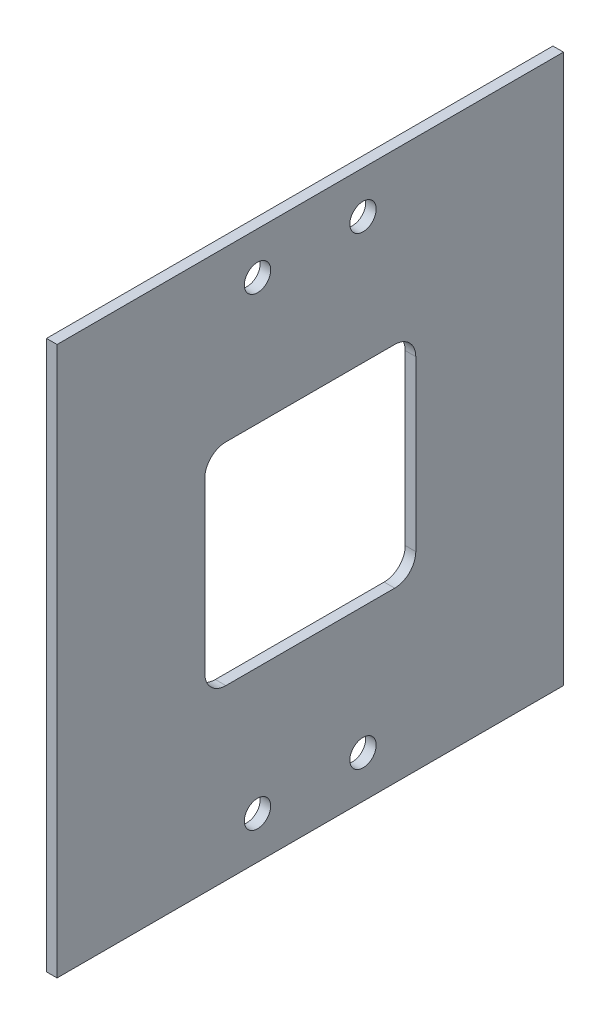
ISO-10303-21;
HEADER;
FILE_DESCRIPTION(('STEP AP214'),'2;1');
FILE_NAME('part.step','',(''),(''),'','','');
FILE_SCHEMA(('AUTOMOTIVE_DESIGN { 1 0 10303 214 1 1 1 1 }'));
ENDSEC;
DATA;
#1=APPLICATION_CONTEXT('core data for automotive mechanical design processes');
#2=APPLICATION_PROTOCOL_DEFINITION('international standard','automotive_design',2000,#1);
#3=PRODUCT_CONTEXT('',#1,'mechanical');
#4=PRODUCT('Part','Part','',(#3));
#5=PRODUCT_RELATED_PRODUCT_CATEGORY('part','',(#4));
#6=PRODUCT_DEFINITION_FORMATION('','',#4);
#7=PRODUCT_DEFINITION_CONTEXT('part definition',#1,'design');
#8=PRODUCT_DEFINITION('design','',#6,#7);
#9=PRODUCT_DEFINITION_SHAPE('','',#8);
#10=(LENGTH_UNIT() NAMED_UNIT(*) SI_UNIT(.MILLI.,.METRE.));
#11=(NAMED_UNIT(*) PLANE_ANGLE_UNIT() SI_UNIT($,.RADIAN.));
#12=(NAMED_UNIT(*) SI_UNIT($,.STERADIAN.) SOLID_ANGLE_UNIT());
#13=UNCERTAINTY_MEASURE_WITH_UNIT(LENGTH_MEASURE(1.E-05),#10,'distance_accuracy_value','');
#14=(GEOMETRIC_REPRESENTATION_CONTEXT(3) GLOBAL_UNCERTAINTY_ASSIGNED_CONTEXT((#13)) GLOBAL_UNIT_ASSIGNED_CONTEXT((#10,
#11,#12)) REPRESENTATION_CONTEXT('',''));
#15=CARTESIAN_POINT('',(0.,0.,0.));
#16=DIRECTION('',(0.,0.,1.));
#17=DIRECTION('',(1.,0.,0.));
#18=AXIS2_PLACEMENT_3D('',#15,#16,#17);
#19=CARTESIAN_POINT('',(3.175,82.55,0.));
#20=DIRECTION('',(0.,0.,-1.));
#21=DIRECTION('',(0.,1.,0.));
#22=AXIS2_PLACEMENT_3D('',#19,#20,#21);
#23=PLANE('',#22);
#24=DIRECTION('',(0.,-1.,0.));
#25=VECTOR('',#24,1.);
#26=CARTESIAN_POINT('',(0.,82.55,0.));
#27=LINE('',#26,#25);
#28=CARTESIAN_POINT('',(0.,82.55,0.));
#29=VERTEX_POINT('',#28);
#30=CARTESIAN_POINT('',(0.,-82.55,0.));
#31=VERTEX_POINT('',#30);
#32=EDGE_CURVE('E234',#29,#31,#27,.T.);
#33=ORIENTED_EDGE('',*,*,#32,.T.);
#34=DIRECTION('',(-1.,0.,0.));
#35=VECTOR('',#34,1.);
#36=CARTESIAN_POINT('',(3.175,-82.55,0.));
#37=LINE('',#36,#35);
#38=CARTESIAN_POINT('',(3.175,-82.55,0.));
#39=VERTEX_POINT('',#38);
#40=EDGE_CURVE('E11',#39,#31,#37,.T.);
#41=ORIENTED_EDGE('',*,*,#40,.F.);
#42=DIRECTION('',(0.,-1.,0.));
#43=VECTOR('',#42,1.);
#44=CARTESIAN_POINT('',(3.175,82.55,0.));
#45=LINE('',#44,#43);
#46=CARTESIAN_POINT('',(3.175,82.55,0.));
#47=VERTEX_POINT('',#46);
#48=EDGE_CURVE('E251',#47,#39,#45,.T.);
#49=ORIENTED_EDGE('',*,*,#48,.F.);
#50=DIRECTION('',(-1.,0.,0.));
#51=VECTOR('',#50,1.);
#52=CARTESIAN_POINT('',(3.175,82.55,0.));
#53=LINE('',#52,#51);
#54=EDGE_CURVE('E265',#47,#29,#53,.T.);
#55=ORIENTED_EDGE('',*,*,#54,.T.);
#56=EDGE_LOOP('',(#33,#41,#49,#55));
#57=FACE_BOUND('',#56,.T.);
#58=ADVANCED_FACE('F41',(#57),#23,.F.);
#59=CARTESIAN_POINT('',(3.175,-82.55,-152.4));
#60=DIRECTION('',(0.,1.,0.));
#61=DIRECTION('',(0.,0.,1.));
#62=AXIS2_PLACEMENT_3D('',#59,#60,#61);
#63=PLANE('',#62);
#64=DIRECTION('',(0.,0.,-1.));
#65=VECTOR('',#64,1.);
#66=CARTESIAN_POINT('',(0.,-82.55,-152.4));
#67=LINE('',#66,#65);
#68=CARTESIAN_POINT('',(0.,-82.55,-152.4));
#69=VERTEX_POINT('',#68);
#70=EDGE_CURVE('E269',#31,#69,#67,.T.);
#71=ORIENTED_EDGE('',*,*,#70,.T.);
#72=DIRECTION('',(-1.,0.,0.));
#73=VECTOR('',#72,1.);
#74=CARTESIAN_POINT('',(3.175,-82.55,-152.4));
#75=LINE('',#74,#73);
#76=CARTESIAN_POINT('',(3.175,-82.55,-152.4));
#77=VERTEX_POINT('',#76);
#78=EDGE_CURVE('E49',#77,#69,#75,.T.);
#79=ORIENTED_EDGE('',*,*,#78,.F.);
#80=DIRECTION('',(0.,0.,-1.));
#81=VECTOR('',#80,1.);
#82=CARTESIAN_POINT('',(3.175,-82.55,-152.4));
#83=LINE('',#82,#81);
#84=EDGE_CURVE('E255',#39,#77,#83,.T.);
#85=ORIENTED_EDGE('',*,*,#84,.F.);
#86=ORIENTED_EDGE('',*,*,#40,.T.);
#87=EDGE_LOOP('',(#71,#79,#85,#86));
#88=FACE_BOUND('',#87,.T.);
#89=ADVANCED_FACE('F303',(#88),#63,.F.);
#90=CARTESIAN_POINT('',(3.175,82.55,-152.4));
#91=DIRECTION('',(0.,0.,1.));
#92=DIRECTION('',(0.,-1.,0.));
#93=AXIS2_PLACEMENT_3D('',#90,#91,#92);
#94=PLANE('',#93);
#95=DIRECTION('',(0.,1.,0.));
#96=VECTOR('',#95,1.);
#97=CARTESIAN_POINT('',(0.,82.55,-152.4));
#98=LINE('',#97,#96);
#99=CARTESIAN_POINT('',(0.,82.55,-152.4));
#100=VERTEX_POINT('',#99);
#101=EDGE_CURVE('E272',#69,#100,#98,.T.);
#102=ORIENTED_EDGE('',*,*,#101,.T.);
#103=DIRECTION('',(-1.,0.,0.));
#104=VECTOR('',#103,1.);
#105=CARTESIAN_POINT('',(3.175,82.55,-152.4));
#106=LINE('',#105,#104);
#107=CARTESIAN_POINT('',(3.175,82.55,-152.4));
#108=VERTEX_POINT('',#107);
#109=EDGE_CURVE('E280',#108,#100,#106,.T.);
#110=ORIENTED_EDGE('',*,*,#109,.F.);
#111=DIRECTION('',(0.,1.,0.));
#112=VECTOR('',#111,1.);
#113=CARTESIAN_POINT('',(3.175,82.55,-152.4));
#114=LINE('',#113,#112);
#115=EDGE_CURVE('E259',#77,#108,#114,.T.);
#116=ORIENTED_EDGE('',*,*,#115,.F.);
#117=ORIENTED_EDGE('',*,*,#78,.T.);
#118=EDGE_LOOP('',(#102,#110,#116,#117));
#119=FACE_BOUND('',#118,.T.);
#120=ADVANCED_FACE('F289',(#119),#94,.F.);
#121=CARTESIAN_POINT('',(3.175,82.55,-152.4));
#122=DIRECTION('',(0.,-1.,0.));
#123=DIRECTION('',(0.,0.,-1.));
#124=AXIS2_PLACEMENT_3D('',#121,#122,#123);
#125=PLANE('',#124);
#126=DIRECTION('',(0.,0.,1.));
#127=VECTOR('',#126,1.);
#128=CARTESIAN_POINT('',(0.,82.55,-152.4));
#129=LINE('',#128,#127);
#130=EDGE_CURVE('E256',#100,#29,#129,.T.);
#131=ORIENTED_EDGE('',*,*,#130,.T.);
#132=ORIENTED_EDGE('',*,*,#54,.F.);
#133=DIRECTION('',(0.,0.,1.));
#134=VECTOR('',#133,1.);
#135=CARTESIAN_POINT('',(3.175,82.55,-152.4));
#136=LINE('',#135,#134);
#137=EDGE_CURVE('E262',#108,#47,#136,.T.);
#138=ORIENTED_EDGE('',*,*,#137,.F.);
#139=ORIENTED_EDGE('',*,*,#109,.T.);
#140=EDGE_LOOP('',(#131,#132,#138,#139));
#141=FACE_BOUND('',#140,.T.);
#142=ADVANCED_FACE('F298',(#141),#125,.F.);
#143=CARTESIAN_POINT('',(3.175,-82.55,0.));
#144=DIRECTION('',(-1.,0.,0.));
#145=DIRECTION('',(0.,0.,1.));
#146=AXIS2_PLACEMENT_3D('',#143,#144,#145);
#147=PLANE('',#146);
#148=CARTESIAN_POINT('',(3.175,-69.85,-60.325));
#149=DIRECTION('',(-1.,0.,0.));
#150=DIRECTION('',(0.,0.,1.));
#151=AXIS2_PLACEMENT_3D('',#148,#149,#150);
#152=CIRCLE('',#151,3.96875);
#153=CARTESIAN_POINT('',(3.175,-69.85,-56.35625));
#154=VERTEX_POINT('',#153);
#155=EDGE_CURVE('E366',#154,#154,#152,.T.);
#156=ORIENTED_EDGE('',*,*,#155,.T.);
#157=EDGE_LOOP('',(#156));
#158=FACE_BOUND('',#157,.T.);
#159=CARTESIAN_POINT('',(3.175,-69.85,-92.075));
#160=DIRECTION('',(-1.,0.,0.));
#161=DIRECTION('',(0.,0.,1.));
#162=AXIS2_PLACEMENT_3D('',#159,#160,#161);
#163=CIRCLE('',#162,3.96874999999999);
#164=CARTESIAN_POINT('',(3.175,-69.85,-88.10625));
#165=VERTEX_POINT('',#164);
#166=EDGE_CURVE('E376',#165,#165,#163,.T.);
#167=ORIENTED_EDGE('',*,*,#166,.T.);
#168=EDGE_LOOP('',(#167));
#169=FACE_BOUND('',#168,.T.);
#170=CARTESIAN_POINT('',(3.175,69.85,-92.075));
#171=DIRECTION('',(-1.,0.,0.));
#172=DIRECTION('',(0.,0.,1.));
#173=AXIS2_PLACEMENT_3D('',#170,#171,#172);
#174=CIRCLE('',#173,3.96875);
#175=CARTESIAN_POINT('',(3.175,69.85,-88.10625));
#176=VERTEX_POINT('',#175);
#177=EDGE_CURVE('E384',#176,#176,#174,.T.);
#178=ORIENTED_EDGE('',*,*,#177,.T.);
#179=EDGE_LOOP('',(#178));
#180=FACE_BOUND('',#179,.T.);
#181=CARTESIAN_POINT('',(3.175,69.85,-60.325));
#182=DIRECTION('',(-1.,0.,0.));
#183=DIRECTION('',(0.,0.,1.));
#184=AXIS2_PLACEMENT_3D('',#181,#182,#183);
#185=CIRCLE('',#184,3.96875);
#186=CARTESIAN_POINT('',(3.175,69.85,-56.35625));
#187=VERTEX_POINT('',#186);
#188=EDGE_CURVE('E210',#187,#187,#185,.T.);
#189=ORIENTED_EDGE('',*,*,#188,.T.);
#190=EDGE_LOOP('',(#189));
#191=FACE_BOUND('',#190,.T.);
#192=CARTESIAN_POINT('',(3.175,-25.4,-101.6));
#193=DIRECTION('',(-1.,0.,0.));
#194=DIRECTION('',(0.,0.,1.));
#195=AXIS2_PLACEMENT_3D('',#192,#193,#194);
#196=CIRCLE('',#195,6.35000000000001);
#197=CARTESIAN_POINT('',(3.175,-25.4,-107.95));
#198=VERTEX_POINT('',#197);
#199=CARTESIAN_POINT('',(3.175,-31.75,-101.6));
#200=VERTEX_POINT('',#199);
#201=EDGE_CURVE('E163',#198,#200,#196,.T.);
#202=ORIENTED_EDGE('',*,*,#201,.T.);
#203=DIRECTION('',(0.,0.,1.));
#204=VECTOR('',#203,1.);
#205=CARTESIAN_POINT('',(3.175,-31.75,-76.2));
#206=LINE('',#205,#204);
#207=CARTESIAN_POINT('',(3.175,-31.75,-50.8));
#208=VERTEX_POINT('',#207);
#209=EDGE_CURVE('E156',#200,#208,#206,.T.);
#210=ORIENTED_EDGE('',*,*,#209,.T.);
#211=CARTESIAN_POINT('',(3.175,-25.4,-50.8));
#212=DIRECTION('',(-1.,0.,0.));
#213=DIRECTION('',(0.,0.,1.));
#214=AXIS2_PLACEMENT_3D('',#211,#212,#213);
#215=CIRCLE('',#214,6.35000000000001);
#216=CARTESIAN_POINT('',(3.175,-25.4,-44.45));
#217=VERTEX_POINT('',#216);
#218=EDGE_CURVE('E166',#208,#217,#215,.T.);
#219=ORIENTED_EDGE('',*,*,#218,.T.);
#220=DIRECTION('',(0.,1.,0.));
#221=VECTOR('',#220,1.);
#222=CARTESIAN_POINT('',(3.175,-174.906065520897,-44.45));
#223=LINE('',#222,#221);
#224=CARTESIAN_POINT('',(3.175,25.4,-44.45));
#225=VERTEX_POINT('',#224);
#226=EDGE_CURVE('E59',#217,#225,#223,.T.);
#227=ORIENTED_EDGE('',*,*,#226,.T.);
#228=CARTESIAN_POINT('',(3.175,25.4,-50.8));
#229=DIRECTION('',(-1.,0.,0.));
#230=DIRECTION('',(0.,0.,1.));
#231=AXIS2_PLACEMENT_3D('',#228,#229,#230);
#232=CIRCLE('',#231,6.35000000000001);
#233=CARTESIAN_POINT('',(3.175,31.75,-50.8));
#234=VERTEX_POINT('',#233);
#235=EDGE_CURVE('E190',#225,#234,#232,.T.);
#236=ORIENTED_EDGE('',*,*,#235,.T.);
#237=DIRECTION('',(0.,0.,-1.));
#238=VECTOR('',#237,1.);
#239=CARTESIAN_POINT('',(3.175,31.75,-76.2));
#240=LINE('',#239,#238);
#241=CARTESIAN_POINT('',(3.175,31.75,-101.6));
#242=VERTEX_POINT('',#241);
#243=EDGE_CURVE('E194',#234,#242,#240,.T.);
#244=ORIENTED_EDGE('',*,*,#243,.T.);
#245=CARTESIAN_POINT('',(3.175,25.4,-101.6));
#246=DIRECTION('',(-1.,0.,0.));
#247=DIRECTION('',(0.,0.,1.));
#248=AXIS2_PLACEMENT_3D('',#245,#246,#247);
#249=CIRCLE('',#248,6.35000000000001);
#250=CARTESIAN_POINT('',(3.175,25.4,-107.95));
#251=VERTEX_POINT('',#250);
#252=EDGE_CURVE('E198',#242,#251,#249,.T.);
#253=ORIENTED_EDGE('',*,*,#252,.T.);
#254=DIRECTION('',(0.,-1.,0.));
#255=VECTOR('',#254,1.);
#256=CARTESIAN_POINT('',(3.175,-174.906065520897,-107.95));
#257=LINE('',#256,#255);
#258=EDGE_CURVE('E202',#251,#198,#257,.T.);
#259=ORIENTED_EDGE('',*,*,#258,.T.);
#260=EDGE_LOOP('',(#202,#210,#219,#227,#236,#244,#253,#259));
#261=FACE_BOUND('',#260,.T.);
#262=ORIENTED_EDGE('',*,*,#48,.T.);
#263=ORIENTED_EDGE('',*,*,#84,.T.);
#264=ORIENTED_EDGE('',*,*,#115,.T.);
#265=ORIENTED_EDGE('',*,*,#137,.T.);
#266=EDGE_LOOP('',(#262,#263,#264,#265));
#267=FACE_BOUND('',#266,.T.);
#268=ADVANCED_FACE('F171',(#158,#169,#180,#191,#261,#267),#147,.F.);
#269=CARTESIAN_POINT('',(0.,-82.55,0.));
#270=DIRECTION('',(-1.,0.,0.));
#271=DIRECTION('',(0.,0.,1.));
#272=AXIS2_PLACEMENT_3D('',#269,#270,#271);
#273=PLANE('',#272);
#274=CARTESIAN_POINT('',(0.,-69.85,-60.325));
#275=DIRECTION('',(-1.,0.,0.));
#276=DIRECTION('',(0.,0.,1.));
#277=AXIS2_PLACEMENT_3D('',#274,#275,#276);
#278=CIRCLE('',#277,3.96875);
#279=CARTESIAN_POINT('',(0.,-69.85,-56.35625));
#280=VERTEX_POINT('',#279);
#281=EDGE_CURVE('E369',#280,#280,#278,.T.);
#282=ORIENTED_EDGE('',*,*,#281,.F.);
#283=EDGE_LOOP('',(#282));
#284=FACE_BOUND('',#283,.T.);
#285=CARTESIAN_POINT('',(0.,-69.85,-92.075));
#286=DIRECTION('',(-1.,0.,0.));
#287=DIRECTION('',(0.,0.,1.));
#288=AXIS2_PLACEMENT_3D('',#285,#286,#287);
#289=CIRCLE('',#288,3.96874999999999);
#290=CARTESIAN_POINT('',(0.,-69.85,-88.10625));
#291=VERTEX_POINT('',#290);
#292=EDGE_CURVE('E373',#291,#291,#289,.T.);
#293=ORIENTED_EDGE('',*,*,#292,.F.);
#294=EDGE_LOOP('',(#293));
#295=FACE_BOUND('',#294,.T.);
#296=CARTESIAN_POINT('',(0.,69.85,-92.075));
#297=DIRECTION('',(-1.,0.,0.));
#298=DIRECTION('',(0.,0.,1.));
#299=AXIS2_PLACEMENT_3D('',#296,#297,#298);
#300=CIRCLE('',#299,3.96875);
#301=CARTESIAN_POINT('',(0.,69.85,-88.10625));
#302=VERTEX_POINT('',#301);
#303=EDGE_CURVE('E380',#302,#302,#300,.T.);
#304=ORIENTED_EDGE('',*,*,#303,.F.);
#305=EDGE_LOOP('',(#304));
#306=FACE_BOUND('',#305,.T.);
#307=CARTESIAN_POINT('',(0.,69.85,-60.325));
#308=DIRECTION('',(-1.,0.,0.));
#309=DIRECTION('',(0.,0.,1.));
#310=AXIS2_PLACEMENT_3D('',#307,#308,#309);
#311=CIRCLE('',#310,3.96875);
#312=CARTESIAN_POINT('',(0.,69.85,-56.35625));
#313=VERTEX_POINT('',#312);
#314=EDGE_CURVE('E185',#313,#313,#311,.T.);
#315=ORIENTED_EDGE('',*,*,#314,.F.);
#316=EDGE_LOOP('',(#315));
#317=FACE_BOUND('',#316,.T.);
#318=DIRECTION('',(0.,0.,1.));
#319=VECTOR('',#318,1.);
#320=CARTESIAN_POINT('',(0.,-31.75,-76.2));
#321=LINE('',#320,#319);
#322=CARTESIAN_POINT('',(0.,-31.75,-101.6));
#323=VERTEX_POINT('',#322);
#324=CARTESIAN_POINT('',(0.,-31.75,-50.8));
#325=VERTEX_POINT('',#324);
#326=EDGE_CURVE('E70',#323,#325,#321,.T.);
#327=ORIENTED_EDGE('',*,*,#326,.F.);
#328=CARTESIAN_POINT('',(0.,-25.4,-101.6));
#329=DIRECTION('',(-1.,0.,0.));
#330=DIRECTION('',(0.,0.,1.));
#331=AXIS2_PLACEMENT_3D('',#328,#329,#330);
#332=CIRCLE('',#331,6.35000000000001);
#333=CARTESIAN_POINT('',(0.,-25.4,-107.95));
#334=VERTEX_POINT('',#333);
#335=EDGE_CURVE('E176',#334,#323,#332,.T.);
#336=ORIENTED_EDGE('',*,*,#335,.F.);
#337=DIRECTION('',(0.,-1.,0.));
#338=VECTOR('',#337,1.);
#339=CARTESIAN_POINT('',(0.,-174.906065520897,-107.95));
#340=LINE('',#339,#338);
#341=CARTESIAN_POINT('',(0.,25.4,-107.95));
#342=VERTEX_POINT('',#341);
#343=EDGE_CURVE('E182',#342,#334,#340,.T.);
#344=ORIENTED_EDGE('',*,*,#343,.F.);
#345=CARTESIAN_POINT('',(0.,25.4,-101.6));
#346=DIRECTION('',(-1.,0.,0.));
#347=DIRECTION('',(0.,0.,1.));
#348=AXIS2_PLACEMENT_3D('',#345,#346,#347);
#349=CIRCLE('',#348,6.35000000000001);
#350=CARTESIAN_POINT('',(0.,31.75,-101.6));
#351=VERTEX_POINT('',#350);
#352=EDGE_CURVE('E225',#351,#342,#349,.T.);
#353=ORIENTED_EDGE('',*,*,#352,.F.);
#354=DIRECTION('',(0.,0.,-1.));
#355=VECTOR('',#354,1.);
#356=CARTESIAN_POINT('',(0.,31.75,-76.2));
#357=LINE('',#356,#355);
#358=CARTESIAN_POINT('',(0.,31.75,-50.8));
#359=VERTEX_POINT('',#358);
#360=EDGE_CURVE('E221',#359,#351,#357,.T.);
#361=ORIENTED_EDGE('',*,*,#360,.F.);
#362=CARTESIAN_POINT('',(0.,25.4,-50.8));
#363=DIRECTION('',(-1.,0.,0.));
#364=DIRECTION('',(0.,0.,1.));
#365=AXIS2_PLACEMENT_3D('',#362,#363,#364);
#366=CIRCLE('',#365,6.35000000000001);
#367=CARTESIAN_POINT('',(0.,25.4,-44.45));
#368=VERTEX_POINT('',#367);
#369=EDGE_CURVE('E217',#368,#359,#366,.T.);
#370=ORIENTED_EDGE('',*,*,#369,.F.);
#371=DIRECTION('',(0.,1.,0.));
#372=VECTOR('',#371,1.);
#373=CARTESIAN_POINT('',(0.,-174.906065520897,-44.45));
#374=LINE('',#373,#372);
#375=CARTESIAN_POINT('',(0.,-25.4,-44.45));
#376=VERTEX_POINT('',#375);
#377=EDGE_CURVE('E213',#376,#368,#374,.T.);
#378=ORIENTED_EDGE('',*,*,#377,.F.);
#379=CARTESIAN_POINT('',(0.,-25.4,-50.8));
#380=DIRECTION('',(-1.,0.,0.));
#381=DIRECTION('',(0.,0.,1.));
#382=AXIS2_PLACEMENT_3D('',#379,#380,#381);
#383=CIRCLE('',#382,6.35000000000001);
#384=EDGE_CURVE('E209',#325,#376,#383,.T.);
#385=ORIENTED_EDGE('',*,*,#384,.F.);
#386=EDGE_LOOP('',(#327,#336,#344,#353,#361,#370,#378,#385));
#387=FACE_BOUND('',#386,.T.);
#388=ORIENTED_EDGE('',*,*,#32,.F.);
#389=ORIENTED_EDGE('',*,*,#130,.F.);
#390=ORIENTED_EDGE('',*,*,#101,.F.);
#391=ORIENTED_EDGE('',*,*,#70,.F.);
#392=EDGE_LOOP('',(#388,#389,#390,#391));
#393=FACE_BOUND('',#392,.T.);
#394=ADVANCED_FACE('F295',(#284,#295,#306,#317,#387,#393),#273,.T.);
#395=CARTESIAN_POINT('',(3.175,-31.75,-76.2));
#396=DIRECTION('',(0.,-1.,0.));
#397=DIRECTION('',(0.,0.,-1.));
#398=AXIS2_PLACEMENT_3D('',#395,#396,#397);
#399=PLANE('',#398);
#400=ORIENTED_EDGE('',*,*,#326,.T.);
#401=DIRECTION('',(-1.,0.,0.));
#402=VECTOR('',#401,1.);
#403=CARTESIAN_POINT('',(3.175,-31.75,-50.8));
#404=LINE('',#403,#402);
#405=EDGE_CURVE('E152',#208,#325,#404,.T.);
#406=ORIENTED_EDGE('',*,*,#405,.F.);
#407=ORIENTED_EDGE('',*,*,#209,.F.);
#408=DIRECTION('',(-1.,0.,0.));
#409=VECTOR('',#408,1.);
#410=CARTESIAN_POINT('',(3.175,-31.75,-101.6));
#411=LINE('',#410,#409);
#412=EDGE_CURVE('E232',#200,#323,#411,.T.);
#413=ORIENTED_EDGE('',*,*,#412,.T.);
#414=EDGE_LOOP('',(#400,#406,#407,#413));
#415=FACE_BOUND('',#414,.T.);
#416=ADVANCED_FACE('F154',(#415),#399,.F.);
#417=CARTESIAN_POINT('',(3.175,-25.4,-101.6));
#418=DIRECTION('',(-1.,0.,0.));
#419=DIRECTION('',(0.,0.,1.));
#420=AXIS2_PLACEMENT_3D('',#417,#418,#419);
#421=CYLINDRICAL_SURFACE('',#420,6.35000000000001);
#422=ORIENTED_EDGE('',*,*,#335,.T.);
#423=ORIENTED_EDGE('',*,*,#412,.F.);
#424=ORIENTED_EDGE('',*,*,#201,.F.);
#425=DIRECTION('',(-1.,0.,0.));
#426=VECTOR('',#425,1.);
#427=CARTESIAN_POINT('',(3.175,-25.4,-107.95));
#428=LINE('',#427,#426);
#429=EDGE_CURVE('E235',#198,#334,#428,.T.);
#430=ORIENTED_EDGE('',*,*,#429,.T.);
#431=EDGE_LOOP('',(#422,#423,#424,#430));
#432=FACE_BOUND('',#431,.T.);
#433=ADVANCED_FACE('F321',(#432),#421,.F.);
#434=CARTESIAN_POINT('',(3.175,-174.906065520897,-107.95));
#435=DIRECTION('',(0.,0.,-1.));
#436=DIRECTION('',(-1.,0.,0.));
#437=AXIS2_PLACEMENT_3D('',#434,#435,#436);
#438=PLANE('',#437);
#439=ORIENTED_EDGE('',*,*,#343,.T.);
#440=ORIENTED_EDGE('',*,*,#429,.F.);
#441=ORIENTED_EDGE('',*,*,#258,.F.);
#442=DIRECTION('',(-1.,0.,0.));
#443=VECTOR('',#442,1.);
#444=CARTESIAN_POINT('',(3.175,25.4,-107.95));
#445=LINE('',#444,#443);
#446=EDGE_CURVE('E238',#251,#342,#445,.T.);
#447=ORIENTED_EDGE('',*,*,#446,.T.);
#448=EDGE_LOOP('',(#439,#440,#441,#447));
#449=FACE_BOUND('',#448,.T.);
#450=ADVANCED_FACE('F339',(#449),#438,.F.);
#451=CARTESIAN_POINT('',(3.175,25.4,-101.6));
#452=DIRECTION('',(-1.,0.,0.));
#453=DIRECTION('',(0.,0.,1.));
#454=AXIS2_PLACEMENT_3D('',#451,#452,#453);
#455=CYLINDRICAL_SURFACE('',#454,6.35000000000001);
#456=ORIENTED_EDGE('',*,*,#352,.T.);
#457=ORIENTED_EDGE('',*,*,#446,.F.);
#458=ORIENTED_EDGE('',*,*,#252,.F.);
#459=DIRECTION('',(-1.,0.,0.));
#460=VECTOR('',#459,1.);
#461=CARTESIAN_POINT('',(3.175,31.75,-101.6));
#462=LINE('',#461,#460);
#463=EDGE_CURVE('E240',#242,#351,#462,.T.);
#464=ORIENTED_EDGE('',*,*,#463,.T.);
#465=EDGE_LOOP('',(#456,#457,#458,#464));
#466=FACE_BOUND('',#465,.T.);
#467=ADVANCED_FACE('F335',(#466),#455,.F.);
#468=CARTESIAN_POINT('',(3.175,31.75,-76.2));
#469=DIRECTION('',(0.,1.,0.));
#470=DIRECTION('',(0.,0.,1.));
#471=AXIS2_PLACEMENT_3D('',#468,#469,#470);
#472=PLANE('',#471);
#473=ORIENTED_EDGE('',*,*,#360,.T.);
#474=ORIENTED_EDGE('',*,*,#463,.F.);
#475=ORIENTED_EDGE('',*,*,#243,.F.);
#476=DIRECTION('',(-1.,0.,0.));
#477=VECTOR('',#476,1.);
#478=CARTESIAN_POINT('',(3.175,31.75,-50.8));
#479=LINE('',#478,#477);
#480=EDGE_CURVE('E243',#234,#359,#479,.T.);
#481=ORIENTED_EDGE('',*,*,#480,.T.);
#482=EDGE_LOOP('',(#473,#474,#475,#481));
#483=FACE_BOUND('',#482,.T.);
#484=ADVANCED_FACE('F331',(#483),#472,.F.);
#485=CARTESIAN_POINT('',(3.175,25.4,-50.8));
#486=DIRECTION('',(-1.,0.,0.));
#487=DIRECTION('',(0.,0.,1.));
#488=AXIS2_PLACEMENT_3D('',#485,#486,#487);
#489=CYLINDRICAL_SURFACE('',#488,6.35000000000001);
#490=ORIENTED_EDGE('',*,*,#369,.T.);
#491=ORIENTED_EDGE('',*,*,#480,.F.);
#492=ORIENTED_EDGE('',*,*,#235,.F.);
#493=DIRECTION('',(-1.,0.,0.));
#494=VECTOR('',#493,1.);
#495=CARTESIAN_POINT('',(3.175,25.4,-44.45));
#496=LINE('',#495,#494);
#497=EDGE_CURVE('E246',#225,#368,#496,.T.);
#498=ORIENTED_EDGE('',*,*,#497,.T.);
#499=EDGE_LOOP('',(#490,#491,#492,#498));
#500=FACE_BOUND('',#499,.T.);
#501=ADVANCED_FACE('F328',(#500),#489,.F.);
#502=CARTESIAN_POINT('',(3.175,-174.906065520897,-44.45));
#503=DIRECTION('',(0.,0.,1.));
#504=DIRECTION('',(0.,-1.,0.));
#505=AXIS2_PLACEMENT_3D('',#502,#503,#504);
#506=PLANE('',#505);
#507=ORIENTED_EDGE('',*,*,#377,.T.);
#508=ORIENTED_EDGE('',*,*,#497,.F.);
#509=ORIENTED_EDGE('',*,*,#226,.F.);
#510=DIRECTION('',(-1.,0.,0.));
#511=VECTOR('',#510,1.);
#512=CARTESIAN_POINT('',(3.175,-25.4,-44.45));
#513=LINE('',#512,#511);
#514=EDGE_CURVE('E162',#217,#376,#513,.T.);
#515=ORIENTED_EDGE('',*,*,#514,.T.);
#516=EDGE_LOOP('',(#507,#508,#509,#515));
#517=FACE_BOUND('',#516,.T.);
#518=ADVANCED_FACE('F325',(#517),#506,.F.);
#519=CARTESIAN_POINT('',(3.175,-25.4,-50.8));
#520=DIRECTION('',(-1.,0.,0.));
#521=DIRECTION('',(0.,0.,1.));
#522=AXIS2_PLACEMENT_3D('',#519,#520,#521);
#523=CYLINDRICAL_SURFACE('',#522,6.35000000000001);
#524=ORIENTED_EDGE('',*,*,#384,.T.);
#525=ORIENTED_EDGE('',*,*,#514,.F.);
#526=ORIENTED_EDGE('',*,*,#218,.F.);
#527=ORIENTED_EDGE('',*,*,#405,.T.);
#528=EDGE_LOOP('',(#524,#525,#526,#527));
#529=FACE_BOUND('',#528,.T.);
#530=ADVANCED_FACE('F167',(#529),#523,.F.);
#531=CARTESIAN_POINT('',(3.175,69.85,-60.325));
#532=DIRECTION('',(-1.,0.,0.));
#533=DIRECTION('',(0.,0.,1.));
#534=AXIS2_PLACEMENT_3D('',#531,#532,#533);
#535=CYLINDRICAL_SURFACE('',#534,3.96875);
#536=ORIENTED_EDGE('',*,*,#188,.F.);
#537=EDGE_LOOP('',(#536));
#538=FACE_BOUND('',#537,.T.);
#539=ORIENTED_EDGE('',*,*,#314,.T.);
#540=EDGE_LOOP('',(#539));
#541=FACE_BOUND('',#540,.T.);
#542=ADVANCED_FACE('F324',(#538,#541),#535,.F.);
#543=CARTESIAN_POINT('',(3.175,69.85,-92.075));
#544=DIRECTION('',(-1.,0.,0.));
#545=DIRECTION('',(0.,0.,1.));
#546=AXIS2_PLACEMENT_3D('',#543,#544,#545);
#547=CYLINDRICAL_SURFACE('',#546,3.96875);
#548=ORIENTED_EDGE('',*,*,#177,.F.);
#549=EDGE_LOOP('',(#548));
#550=FACE_BOUND('',#549,.T.);
#551=ORIENTED_EDGE('',*,*,#303,.T.);
#552=EDGE_LOOP('',(#551));
#553=FACE_BOUND('',#552,.T.);
#554=ADVANCED_FACE('F349',(#550,#553),#547,.F.);
#555=CARTESIAN_POINT('',(3.175,-69.85,-92.075));
#556=DIRECTION('',(-1.,0.,0.));
#557=DIRECTION('',(0.,0.,1.));
#558=AXIS2_PLACEMENT_3D('',#555,#556,#557);
#559=CYLINDRICAL_SURFACE('',#558,3.96874999999999);
#560=ORIENTED_EDGE('',*,*,#166,.F.);
#561=EDGE_LOOP('',(#560));
#562=FACE_BOUND('',#561,.T.);
#563=ORIENTED_EDGE('',*,*,#292,.T.);
#564=EDGE_LOOP('',(#563));
#565=FACE_BOUND('',#564,.T.);
#566=ADVANCED_FACE('F353',(#562,#565),#559,.F.);
#567=CARTESIAN_POINT('',(3.175,-69.85,-60.325));
#568=DIRECTION('',(-1.,0.,0.));
#569=DIRECTION('',(0.,0.,1.));
#570=AXIS2_PLACEMENT_3D('',#567,#568,#569);
#571=CYLINDRICAL_SURFACE('',#570,3.96875);
#572=ORIENTED_EDGE('',*,*,#155,.F.);
#573=EDGE_LOOP('',(#572));
#574=FACE_BOUND('',#573,.T.);
#575=ORIENTED_EDGE('',*,*,#281,.T.);
#576=EDGE_LOOP('',(#575));
#577=FACE_BOUND('',#576,.T.);
#578=ADVANCED_FACE('F357',(#574,#577),#571,.F.);
#579=CLOSED_SHELL('',(#58,#89,#120,#142,#268,#394,#416,#433,#450,#467,#484,#501,#518,#530,#542,
#554,#566,#578));
#580=MANIFOLD_SOLID_BREP('B2',#579);
#581=ADVANCED_BREP_SHAPE_REPRESENTATION('',(#18,#580),#14);
#582=SHAPE_DEFINITION_REPRESENTATION(#9,#581);
ENDSEC;
END-ISO-10303-21;
